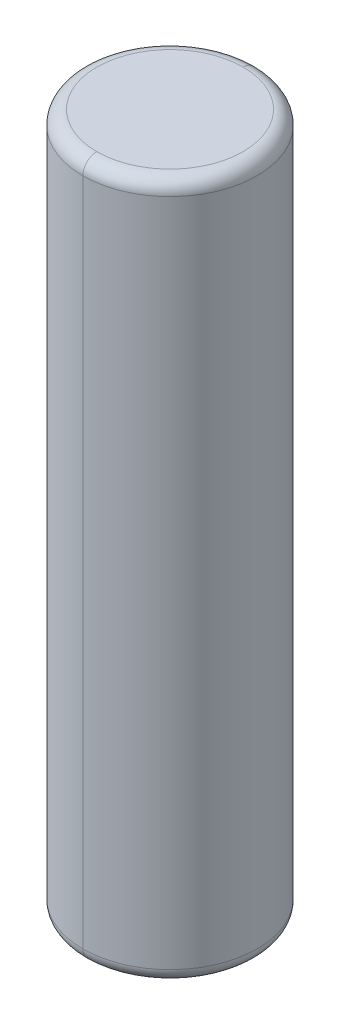
ISO-10303-21;
HEADER;
FILE_DESCRIPTION(('STEP AP214'),'2;1');
FILE_NAME('part.step','',(''),(''),'','','');
FILE_SCHEMA(('AUTOMOTIVE_DESIGN { 1 0 10303 214 1 1 1 1 }'));
ENDSEC;
DATA;
#1=APPLICATION_CONTEXT('core data for automotive mechanical design processes');
#2=APPLICATION_PROTOCOL_DEFINITION('international standard','automotive_design',2000,#1);
#3=PRODUCT_CONTEXT('',#1,'mechanical');
#4=PRODUCT('Part','Part','',(#3));
#5=PRODUCT_RELATED_PRODUCT_CATEGORY('part','',(#4));
#6=PRODUCT_DEFINITION_FORMATION('','',#4);
#7=PRODUCT_DEFINITION_CONTEXT('part definition',#1,'design');
#8=PRODUCT_DEFINITION('design','',#6,#7);
#9=PRODUCT_DEFINITION_SHAPE('','',#8);
#10=(LENGTH_UNIT() NAMED_UNIT(*) SI_UNIT(.MILLI.,.METRE.));
#11=(NAMED_UNIT(*) PLANE_ANGLE_UNIT() SI_UNIT($,.RADIAN.));
#12=(NAMED_UNIT(*) SI_UNIT($,.STERADIAN.) SOLID_ANGLE_UNIT());
#13=UNCERTAINTY_MEASURE_WITH_UNIT(LENGTH_MEASURE(1.E-05),#10,'distance_accuracy_value','');
#14=(GEOMETRIC_REPRESENTATION_CONTEXT(3) GLOBAL_UNCERTAINTY_ASSIGNED_CONTEXT((#13)) GLOBAL_UNIT_ASSIGNED_CONTEXT((#10,
#11,#12)) REPRESENTATION_CONTEXT('',''));
#15=CARTESIAN_POINT('',(0.,0.,0.));
#16=DIRECTION('',(0.,0.,1.));
#17=DIRECTION('',(1.,0.,0.));
#18=AXIS2_PLACEMENT_3D('',#15,#16,#17);
#19=CARTESIAN_POINT('',(0.,25.4,0.));
#20=DIRECTION('',(0.,-1.,0.));
#21=DIRECTION('',(0.,0.,-1.));
#22=AXIS2_PLACEMENT_3D('',#19,#20,#21);
#23=CYLINDRICAL_SURFACE('',#22,3.175);
#24=DIRECTION('',(0.,-1.,0.));
#25=VECTOR('',#24,1.);
#26=CARTESIAN_POINT('',(0.,25.4,3.175));
#27=LINE('',#26,#25);
#28=CARTESIAN_POINT('',(0.,24.892,3.175));
#29=VERTEX_POINT('',#28);
#30=CARTESIAN_POINT('',(0.,0.508000000000008,3.175));
#31=VERTEX_POINT('',#30);
#32=EDGE_CURVE('E119',#29,#31,#27,.T.);
#33=ORIENTED_EDGE('',*,*,#32,.F.);
#34=CARTESIAN_POINT('',(0.,24.892,0.));
#35=DIRECTION('',(0.,-1.,0.));
#36=DIRECTION('',(0.,0.,-1.));
#37=AXIS2_PLACEMENT_3D('',#34,#35,#36);
#38=CIRCLE('',#37,3.175);
#39=CARTESIAN_POINT('',(0.,24.892,-3.175));
#40=VERTEX_POINT('',#39);
#41=EDGE_CURVE('E75',#29,#40,#38,.T.);
#42=ORIENTED_EDGE('',*,*,#41,.T.);
#43=DIRECTION('',(0.,-1.,0.));
#44=VECTOR('',#43,1.);
#45=CARTESIAN_POINT('',(0.,25.4,-3.175));
#46=LINE('',#45,#44);
#47=CARTESIAN_POINT('',(0.,0.508000000000008,-3.175));
#48=VERTEX_POINT('',#47);
#49=EDGE_CURVE('E92',#40,#48,#46,.T.);
#50=ORIENTED_EDGE('',*,*,#49,.T.);
#51=CARTESIAN_POINT('',(0.,0.508000000000008,0.));
#52=DIRECTION('',(0.,-1.,0.));
#53=DIRECTION('',(0.,0.,-1.));
#54=AXIS2_PLACEMENT_3D('',#51,#52,#53);
#55=CIRCLE('',#54,3.175);
#56=EDGE_CURVE('E11',#31,#48,#55,.T.);
#57=ORIENTED_EDGE('',*,*,#56,.F.);
#58=EDGE_LOOP('',(#33,#42,#50,#57));
#59=FACE_BOUND('',#58,.T.);
#60=ADVANCED_FACE('F16',(#59),#23,.T.);
#61=CARTESIAN_POINT('',(0.,0.508000000000008,0.));
#62=DIRECTION('',(0.,-1.,0.));
#63=DIRECTION('',(0.,0.,-1.));
#64=AXIS2_PLACEMENT_3D('',#61,#62,#63);
#65=TOROIDAL_SURFACE('',#64,2.667,0.508);
#66=CARTESIAN_POINT('',(0.,0.508000000000008,2.667));
#67=DIRECTION('',(1.,0.,0.));
#68=DIRECTION('',(0.,0.,-1.));
#69=AXIS2_PLACEMENT_3D('',#66,#67,#68);
#70=CIRCLE('',#69,0.508);
#71=CARTESIAN_POINT('',(0.,0.,2.667));
#72=VERTEX_POINT('',#71);
#73=EDGE_CURVE('E85',#31,#72,#70,.T.);
#74=ORIENTED_EDGE('',*,*,#73,.F.);
#75=ORIENTED_EDGE('',*,*,#56,.T.);
#76=CARTESIAN_POINT('',(0.,0.508000000000008,-2.667));
#77=DIRECTION('',(-1.,0.,0.));
#78=DIRECTION('',(0.,0.,1.));
#79=AXIS2_PLACEMENT_3D('',#76,#77,#78);
#80=CIRCLE('',#79,0.508);
#81=CARTESIAN_POINT('',(0.,0.,-2.667));
#82=VERTEX_POINT('',#81);
#83=EDGE_CURVE('E77',#48,#82,#80,.T.);
#84=ORIENTED_EDGE('',*,*,#83,.T.);
#85=CARTESIAN_POINT('',(0.,0.,0.));
#86=DIRECTION('',(0.,-1.,0.));
#87=DIRECTION('',(0.,0.,-1.));
#88=AXIS2_PLACEMENT_3D('',#85,#86,#87);
#89=CIRCLE('',#88,2.667);
#90=EDGE_CURVE('E20',#72,#82,#89,.T.);
#91=ORIENTED_EDGE('',*,*,#90,.F.);
#92=EDGE_LOOP('',(#74,#75,#84,#91));
#93=FACE_BOUND('',#92,.T.);
#94=ADVANCED_FACE('F18',(#93),#65,.T.);
#95=CARTESIAN_POINT('',(0.,0.,0.));
#96=DIRECTION('',(0.,-1.,0.));
#97=DIRECTION('',(0.,0.,-1.));
#98=AXIS2_PLACEMENT_3D('',#95,#96,#97);
#99=PLANE('',#98);
#100=CARTESIAN_POINT('',(0.,0.,0.));
#101=DIRECTION('',(0.,-1.,0.));
#102=DIRECTION('',(0.,0.,-1.));
#103=AXIS2_PLACEMENT_3D('',#100,#101,#102);
#104=CIRCLE('',#103,2.667);
#105=EDGE_CURVE('E70',#82,#72,#104,.T.);
#106=ORIENTED_EDGE('',*,*,#105,.T.);
#107=ORIENTED_EDGE('',*,*,#90,.T.);
#108=EDGE_LOOP('',(#106,#107));
#109=FACE_BOUND('',#108,.T.);
#110=ADVANCED_FACE('F68',(#109),#99,.T.);
#111=CARTESIAN_POINT('',(2.66699999999996,25.4,0.));
#112=DIRECTION('',(0.,1.,0.));
#113=DIRECTION('',(1.,0.,0.));
#114=AXIS2_PLACEMENT_3D('',#111,#112,#113);
#115=PLANE('',#114);
#116=CARTESIAN_POINT('',(0.,25.4,0.));
#117=DIRECTION('',(0.,-1.,0.));
#118=DIRECTION('',(0.,0.,-1.));
#119=AXIS2_PLACEMENT_3D('',#116,#117,#118);
#120=CIRCLE('',#119,2.667);
#121=CARTESIAN_POINT('',(0.,25.4,-2.667));
#122=VERTEX_POINT('',#121);
#123=CARTESIAN_POINT('',(0.,25.4,2.667));
#124=VERTEX_POINT('',#123);
#125=EDGE_CURVE('E82',#122,#124,#120,.T.);
#126=ORIENTED_EDGE('',*,*,#125,.F.);
#127=CARTESIAN_POINT('',(0.,25.4,0.));
#128=DIRECTION('',(0.,-1.,0.));
#129=DIRECTION('',(0.,0.,-1.));
#130=AXIS2_PLACEMENT_3D('',#127,#128,#129);
#131=CIRCLE('',#130,2.667);
#132=EDGE_CURVE('E39',#124,#122,#131,.T.);
#133=ORIENTED_EDGE('',*,*,#132,.F.);
#134=EDGE_LOOP('',(#126,#133));
#135=FACE_BOUND('',#134,.T.);
#136=ADVANCED_FACE('F220',(#135),#115,.T.);
#137=CARTESIAN_POINT('',(0.,24.892,0.));
#138=DIRECTION('',(0.,-1.,0.));
#139=DIRECTION('',(0.,0.,-1.));
#140=AXIS2_PLACEMENT_3D('',#137,#138,#139);
#141=TOROIDAL_SURFACE('',#140,2.667,0.508);
#142=CARTESIAN_POINT('',(0.,24.892,2.667));
#143=DIRECTION('',(1.,0.,0.));
#144=DIRECTION('',(0.,0.,-1.));
#145=AXIS2_PLACEMENT_3D('',#142,#143,#144);
#146=CIRCLE('',#145,0.508);
#147=EDGE_CURVE('E97',#124,#29,#146,.T.);
#148=ORIENTED_EDGE('',*,*,#147,.F.);
#149=ORIENTED_EDGE('',*,*,#132,.T.);
#150=CARTESIAN_POINT('',(0.,24.892,-2.667));
#151=DIRECTION('',(-1.,0.,0.));
#152=DIRECTION('',(0.,0.,1.));
#153=AXIS2_PLACEMENT_3D('',#150,#151,#152);
#154=CIRCLE('',#153,0.508);
#155=EDGE_CURVE('E101',#122,#40,#154,.T.);
#156=ORIENTED_EDGE('',*,*,#155,.T.);
#157=ORIENTED_EDGE('',*,*,#41,.F.);
#158=EDGE_LOOP('',(#148,#149,#156,#157));
#159=FACE_BOUND('',#158,.T.);
#160=ADVANCED_FACE('F225',(#159),#141,.T.);
#161=CARTESIAN_POINT('',(0.,24.892,0.));
#162=DIRECTION('',(0.,-1.,0.));
#163=DIRECTION('',(0.,0.,-1.));
#164=AXIS2_PLACEMENT_3D('',#161,#162,#163);
#165=TOROIDAL_SURFACE('',#164,2.667,0.508);
#166=ORIENTED_EDGE('',*,*,#125,.T.);
#167=ORIENTED_EDGE('',*,*,#147,.T.);
#168=CARTESIAN_POINT('',(0.,24.892,0.));
#169=DIRECTION('',(0.,-1.,0.));
#170=DIRECTION('',(0.,0.,-1.));
#171=AXIS2_PLACEMENT_3D('',#168,#169,#170);
#172=CIRCLE('',#171,3.175);
#173=EDGE_CURVE('E117',#40,#29,#172,.T.);
#174=ORIENTED_EDGE('',*,*,#173,.F.);
#175=ORIENTED_EDGE('',*,*,#155,.F.);
#176=EDGE_LOOP('',(#166,#167,#174,#175));
#177=FACE_BOUND('',#176,.T.);
#178=ADVANCED_FACE('F213',(#177),#165,.T.);
#179=CARTESIAN_POINT('',(0.,0.508000000000008,0.));
#180=DIRECTION('',(0.,-1.,0.));
#181=DIRECTION('',(0.,0.,-1.));
#182=AXIS2_PLACEMENT_3D('',#179,#180,#181);
#183=TOROIDAL_SURFACE('',#182,2.667,0.508);
#184=CARTESIAN_POINT('',(0.,0.508000000000008,0.));
#185=DIRECTION('',(0.,-1.,0.));
#186=DIRECTION('',(0.,0.,-1.));
#187=AXIS2_PLACEMENT_3D('',#184,#185,#186);
#188=CIRCLE('',#187,3.175);
#189=EDGE_CURVE('E122',#48,#31,#188,.T.);
#190=ORIENTED_EDGE('',*,*,#189,.T.);
#191=ORIENTED_EDGE('',*,*,#73,.T.);
#192=ORIENTED_EDGE('',*,*,#105,.F.);
#193=ORIENTED_EDGE('',*,*,#83,.F.);
#194=EDGE_LOOP('',(#190,#191,#192,#193));
#195=FACE_BOUND('',#194,.T.);
#196=ADVANCED_FACE('F84',(#195),#183,.T.);
#197=CARTESIAN_POINT('',(0.,25.4,0.));
#198=DIRECTION('',(0.,-1.,0.));
#199=DIRECTION('',(0.,0.,-1.));
#200=AXIS2_PLACEMENT_3D('',#197,#198,#199);
#201=CYLINDRICAL_SURFACE('',#200,3.175);
#202=ORIENTED_EDGE('',*,*,#173,.T.);
#203=ORIENTED_EDGE('',*,*,#32,.T.);
#204=ORIENTED_EDGE('',*,*,#189,.F.);
#205=ORIENTED_EDGE('',*,*,#49,.F.);
#206=EDGE_LOOP('',(#202,#203,#204,#205));
#207=FACE_BOUND('',#206,.T.);
#208=ADVANCED_FACE('F136',(#207),#201,.T.);
#209=CLOSED_SHELL('',(#60,#94,#110,#136,#160,#178,#196,#208));
#210=MANIFOLD_SOLID_BREP('B1',#209);
#211=ADVANCED_BREP_SHAPE_REPRESENTATION('',(#18,#210),#14);
#212=SHAPE_DEFINITION_REPRESENTATION(#9,#211);
ENDSEC;
END-ISO-10303-21;
